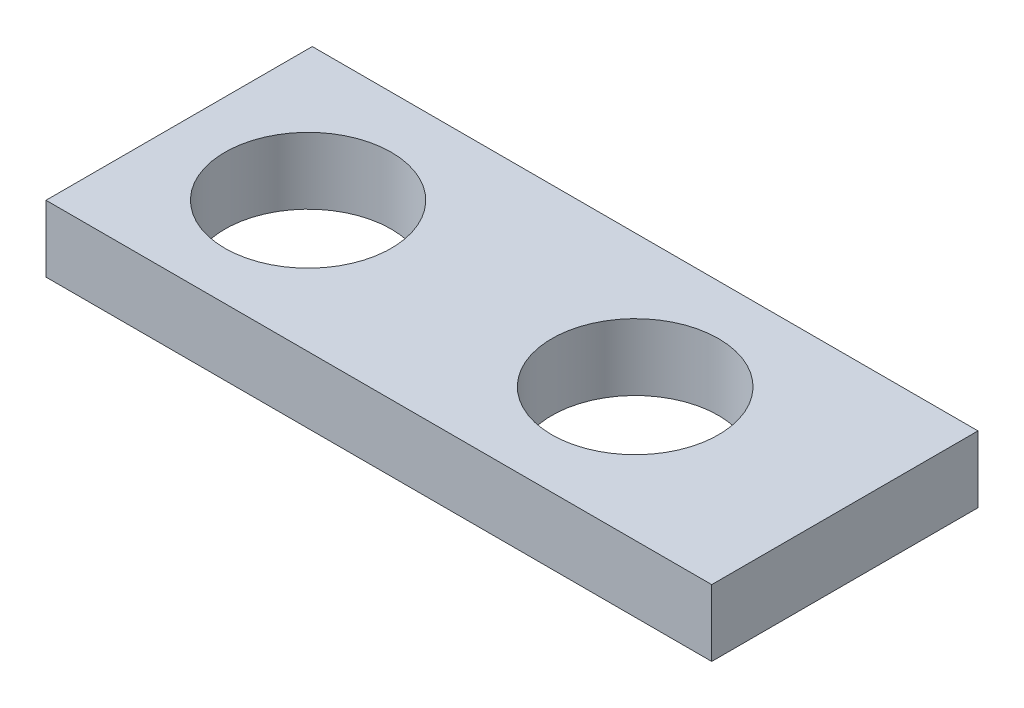
ISO-10303-21;
HEADER;
FILE_DESCRIPTION(('STEP AP214'),'2;1');
FILE_NAME('part.step','',(''),(''),'','','');
FILE_SCHEMA(('AUTOMOTIVE_DESIGN { 1 0 10303 214 1 1 1 1 }'));
ENDSEC;
DATA;
#1=APPLICATION_CONTEXT('core data for automotive mechanical design processes');
#2=APPLICATION_PROTOCOL_DEFINITION('international standard','automotive_design',2000,#1);
#3=PRODUCT_CONTEXT('',#1,'mechanical');
#4=PRODUCT('Part','Part','',(#3));
#5=PRODUCT_RELATED_PRODUCT_CATEGORY('part','',(#4));
#6=PRODUCT_DEFINITION_FORMATION('','',#4);
#7=PRODUCT_DEFINITION_CONTEXT('part definition',#1,'design');
#8=PRODUCT_DEFINITION('design','',#6,#7);
#9=PRODUCT_DEFINITION_SHAPE('','',#8);
#10=(LENGTH_UNIT() NAMED_UNIT(*) SI_UNIT(.MILLI.,.METRE.));
#11=(NAMED_UNIT(*) PLANE_ANGLE_UNIT() SI_UNIT($,.RADIAN.));
#12=(NAMED_UNIT(*) SI_UNIT($,.STERADIAN.) SOLID_ANGLE_UNIT());
#13=UNCERTAINTY_MEASURE_WITH_UNIT(LENGTH_MEASURE(1.E-05),#10,'distance_accuracy_value','');
#14=(GEOMETRIC_REPRESENTATION_CONTEXT(3) GLOBAL_UNCERTAINTY_ASSIGNED_CONTEXT((#13)) GLOBAL_UNIT_ASSIGNED_CONTEXT((#10,
#11,#12)) REPRESENTATION_CONTEXT('',''));
#15=CARTESIAN_POINT('',(0.,0.,0.));
#16=DIRECTION('',(0.,0.,1.));
#17=DIRECTION('',(1.,0.,0.));
#18=AXIS2_PLACEMENT_3D('',#15,#16,#17);
#19=CARTESIAN_POINT('',(0.,12.7,0.));
#20=DIRECTION('',(1.,0.,0.));
#21=DIRECTION('',(0.,0.,-1.));
#22=AXIS2_PLACEMENT_3D('',#19,#20,#21);
#23=PLANE('',#22);
#24=DIRECTION('',(0.,0.,1.));
#25=VECTOR('',#24,1.);
#26=CARTESIAN_POINT('',(0.,0.,0.));
#27=LINE('',#26,#25);
#28=CARTESIAN_POINT('',(0.,0.,-50.8));
#29=VERTEX_POINT('',#28);
#30=CARTESIAN_POINT('',(0.,0.,0.));
#31=VERTEX_POINT('',#30);
#32=EDGE_CURVE('E94',#29,#31,#27,.T.);
#33=ORIENTED_EDGE('',*,*,#32,.T.);
#34=DIRECTION('',(0.,-1.,0.));
#35=VECTOR('',#34,1.);
#36=CARTESIAN_POINT('',(0.,12.7,0.));
#37=LINE('',#36,#35);
#38=CARTESIAN_POINT('',(0.,12.7,0.));
#39=VERTEX_POINT('',#38);
#40=EDGE_CURVE('E11',#39,#31,#37,.T.);
#41=ORIENTED_EDGE('',*,*,#40,.F.);
#42=DIRECTION('',(0.,0.,1.));
#43=VECTOR('',#42,1.);
#44=CARTESIAN_POINT('',(0.,12.7,0.));
#45=LINE('',#44,#43);
#46=CARTESIAN_POINT('',(0.,12.7,-50.8));
#47=VERTEX_POINT('',#46);
#48=EDGE_CURVE('E82',#47,#39,#45,.T.);
#49=ORIENTED_EDGE('',*,*,#48,.F.);
#50=DIRECTION('',(0.,-1.,0.));
#51=VECTOR('',#50,1.);
#52=CARTESIAN_POINT('',(0.,12.7,-50.8));
#53=LINE('',#52,#51);
#54=EDGE_CURVE('E90',#47,#29,#53,.T.);
#55=ORIENTED_EDGE('',*,*,#54,.T.);
#56=EDGE_LOOP('',(#33,#41,#49,#55));
#57=FACE_BOUND('',#56,.T.);
#58=ADVANCED_FACE('F31',(#57),#23,.F.);
#59=CARTESIAN_POINT('',(0.,12.7,0.));
#60=DIRECTION('',(0.,0.,-1.));
#61=DIRECTION('',(-1.,0.,0.));
#62=AXIS2_PLACEMENT_3D('',#59,#60,#61);
#63=PLANE('',#62);
#64=DIRECTION('',(1.,0.,0.));
#65=VECTOR('',#64,1.);
#66=CARTESIAN_POINT('',(0.,0.,0.));
#67=LINE('',#66,#65);
#68=CARTESIAN_POINT('',(127.,0.,0.));
#69=VERTEX_POINT('',#68);
#70=EDGE_CURVE('E86',#31,#69,#67,.T.);
#71=ORIENTED_EDGE('',*,*,#70,.T.);
#72=DIRECTION('',(0.,-1.,0.));
#73=VECTOR('',#72,1.);
#74=CARTESIAN_POINT('',(127.,12.7,0.));
#75=LINE('',#74,#73);
#76=CARTESIAN_POINT('',(127.,12.7,0.));
#77=VERTEX_POINT('',#76);
#78=EDGE_CURVE('E39',#77,#69,#75,.T.);
#79=ORIENTED_EDGE('',*,*,#78,.F.);
#80=DIRECTION('',(1.,0.,0.));
#81=VECTOR('',#80,1.);
#82=CARTESIAN_POINT('',(0.,12.7,0.));
#83=LINE('',#82,#81);
#84=EDGE_CURVE('E77',#39,#77,#83,.T.);
#85=ORIENTED_EDGE('',*,*,#84,.F.);
#86=ORIENTED_EDGE('',*,*,#40,.T.);
#87=EDGE_LOOP('',(#71,#79,#85,#86));
#88=FACE_BOUND('',#87,.T.);
#89=ADVANCED_FACE('F85',(#88),#63,.F.);
#90=CARTESIAN_POINT('',(127.,12.7,0.));
#91=DIRECTION('',(-1.,0.,0.));
#92=DIRECTION('',(0.,0.,1.));
#93=AXIS2_PLACEMENT_3D('',#90,#91,#92);
#94=PLANE('',#93);
#95=DIRECTION('',(0.,0.,-1.));
#96=VECTOR('',#95,1.);
#97=CARTESIAN_POINT('',(127.,0.,0.));
#98=LINE('',#97,#96);
#99=CARTESIAN_POINT('',(127.,0.,-50.8));
#100=VERTEX_POINT('',#99);
#101=EDGE_CURVE('E64',#69,#100,#98,.T.);
#102=ORIENTED_EDGE('',*,*,#101,.T.);
#103=DIRECTION('',(0.,-1.,0.));
#104=VECTOR('',#103,1.);
#105=CARTESIAN_POINT('',(127.,12.7,-50.8));
#106=LINE('',#105,#104);
#107=CARTESIAN_POINT('',(127.,12.7,-50.8));
#108=VERTEX_POINT('',#107);
#109=EDGE_CURVE('E87',#108,#100,#106,.T.);
#110=ORIENTED_EDGE('',*,*,#109,.F.);
#111=DIRECTION('',(0.,0.,-1.));
#112=VECTOR('',#111,1.);
#113=CARTESIAN_POINT('',(127.,12.7,0.));
#114=LINE('',#113,#112);
#115=EDGE_CURVE('E80',#77,#108,#114,.T.);
#116=ORIENTED_EDGE('',*,*,#115,.F.);
#117=ORIENTED_EDGE('',*,*,#78,.T.);
#118=EDGE_LOOP('',(#102,#110,#116,#117));
#119=FACE_BOUND('',#118,.T.);
#120=ADVANCED_FACE('F88',(#119),#94,.F.);
#121=CARTESIAN_POINT('',(0.,12.7,-50.8));
#122=DIRECTION('',(0.,0.,1.));
#123=DIRECTION('',(1.,0.,0.));
#124=AXIS2_PLACEMENT_3D('',#121,#122,#123);
#125=PLANE('',#124);
#126=DIRECTION('',(-1.,0.,0.));
#127=VECTOR('',#126,1.);
#128=CARTESIAN_POINT('',(0.,0.,-50.8));
#129=LINE('',#128,#127);
#130=EDGE_CURVE('E70',#100,#29,#129,.T.);
#131=ORIENTED_EDGE('',*,*,#130,.T.);
#132=ORIENTED_EDGE('',*,*,#54,.F.);
#133=DIRECTION('',(-1.,0.,0.));
#134=VECTOR('',#133,1.);
#135=CARTESIAN_POINT('',(0.,12.7,-50.8));
#136=LINE('',#135,#134);
#137=EDGE_CURVE('E47',#108,#47,#136,.T.);
#138=ORIENTED_EDGE('',*,*,#137,.F.);
#139=ORIENTED_EDGE('',*,*,#109,.T.);
#140=EDGE_LOOP('',(#131,#132,#138,#139));
#141=FACE_BOUND('',#140,.T.);
#142=ADVANCED_FACE('F102',(#141),#125,.F.);
#143=CARTESIAN_POINT('',(0.,12.7,-50.8));
#144=DIRECTION('',(0.,-1.,0.));
#145=DIRECTION('',(0.,0.,-1.));
#146=AXIS2_PLACEMENT_3D('',#143,#144,#145);
#147=PLANE('',#146);
#148=CARTESIAN_POINT('',(87.,12.7,-25.4));
#149=DIRECTION('',(0.,1.,0.));
#150=DIRECTION('',(0.,0.,1.));
#151=AXIS2_PLACEMENT_3D('',#148,#149,#150);
#152=CIRCLE('',#151,15.9);
#153=CARTESIAN_POINT('',(87.,12.7,-9.5));
#154=VERTEX_POINT('',#153);
#155=EDGE_CURVE('E114',#154,#154,#152,.T.);
#156=ORIENTED_EDGE('',*,*,#155,.F.);
#157=EDGE_LOOP('',(#156));
#158=FACE_BOUND('',#157,.T.);
#159=CARTESIAN_POINT('',(25.,12.7,-25.));
#160=DIRECTION('',(0.,1.,0.));
#161=DIRECTION('',(0.,0.,1.));
#162=AXIS2_PLACEMENT_3D('',#159,#160,#161);
#163=CIRCLE('',#162,15.875);
#164=CARTESIAN_POINT('',(25.,12.7,-9.12500000000001));
#165=VERTEX_POINT('',#164);
#166=EDGE_CURVE('E108',#165,#165,#163,.T.);
#167=ORIENTED_EDGE('',*,*,#166,.F.);
#168=EDGE_LOOP('',(#167));
#169=FACE_BOUND('',#168,.T.);
#170=ORIENTED_EDGE('',*,*,#48,.T.);
#171=ORIENTED_EDGE('',*,*,#84,.T.);
#172=ORIENTED_EDGE('',*,*,#115,.T.);
#173=ORIENTED_EDGE('',*,*,#137,.T.);
#174=EDGE_LOOP('',(#170,#171,#172,#173));
#175=FACE_BOUND('',#174,.T.);
#176=ADVANCED_FACE('F78',(#158,#169,#175),#147,.F.);
#177=CARTESIAN_POINT('',(0.,0.,-50.8));
#178=DIRECTION('',(0.,-1.,0.));
#179=DIRECTION('',(0.,0.,-1.));
#180=AXIS2_PLACEMENT_3D('',#177,#178,#179);
#181=PLANE('',#180);
#182=CARTESIAN_POINT('',(87.,0.,-25.4));
#183=DIRECTION('',(0.,1.,0.));
#184=DIRECTION('',(0.,0.,1.));
#185=AXIS2_PLACEMENT_3D('',#182,#183,#184);
#186=CIRCLE('',#185,15.9);
#187=CARTESIAN_POINT('',(87.,0.,-9.5));
#188=VERTEX_POINT('',#187);
#189=EDGE_CURVE('E111',#188,#188,#186,.T.);
#190=ORIENTED_EDGE('',*,*,#189,.T.);
#191=EDGE_LOOP('',(#190));
#192=FACE_BOUND('',#191,.T.);
#193=CARTESIAN_POINT('',(25.,0.,-25.));
#194=DIRECTION('',(0.,1.,0.));
#195=DIRECTION('',(0.,0.,1.));
#196=AXIS2_PLACEMENT_3D('',#193,#194,#195);
#197=CIRCLE('',#196,15.875);
#198=CARTESIAN_POINT('',(25.,0.,-9.12500000000001));
#199=VERTEX_POINT('',#198);
#200=EDGE_CURVE('E97',#199,#199,#197,.T.);
#201=ORIENTED_EDGE('',*,*,#200,.T.);
#202=EDGE_LOOP('',(#201));
#203=FACE_BOUND('',#202,.T.);
#204=ORIENTED_EDGE('',*,*,#32,.F.);
#205=ORIENTED_EDGE('',*,*,#130,.F.);
#206=ORIENTED_EDGE('',*,*,#101,.F.);
#207=ORIENTED_EDGE('',*,*,#70,.F.);
#208=EDGE_LOOP('',(#204,#205,#206,#207));
#209=FACE_BOUND('',#208,.T.);
#210=ADVANCED_FACE('F105',(#192,#203,#209),#181,.T.);
#211=CARTESIAN_POINT('',(25.,0.,-25.));
#212=DIRECTION('',(0.,1.,0.));
#213=DIRECTION('',(0.,0.,1.));
#214=AXIS2_PLACEMENT_3D('',#211,#212,#213);
#215=CYLINDRICAL_SURFACE('',#214,15.875);
#216=ORIENTED_EDGE('',*,*,#200,.F.);
#217=EDGE_LOOP('',(#216));
#218=FACE_BOUND('',#217,.T.);
#219=ORIENTED_EDGE('',*,*,#166,.T.);
#220=EDGE_LOOP('',(#219));
#221=FACE_BOUND('',#220,.T.);
#222=ADVANCED_FACE('F125',(#218,#221),#215,.F.);
#223=CARTESIAN_POINT('',(87.,0.,-25.4));
#224=DIRECTION('',(0.,1.,0.));
#225=DIRECTION('',(0.,0.,1.));
#226=AXIS2_PLACEMENT_3D('',#223,#224,#225);
#227=CYLINDRICAL_SURFACE('',#226,15.9);
#228=ORIENTED_EDGE('',*,*,#189,.F.);
#229=EDGE_LOOP('',(#228));
#230=FACE_BOUND('',#229,.T.);
#231=ORIENTED_EDGE('',*,*,#155,.T.);
#232=EDGE_LOOP('',(#231));
#233=FACE_BOUND('',#232,.T.);
#234=ADVANCED_FACE('F122',(#230,#233),#227,.F.);
#235=CLOSED_SHELL('',(#58,#89,#120,#142,#176,#210,#222,#234));
#236=MANIFOLD_SOLID_BREP('B2',#235);
#237=ADVANCED_BREP_SHAPE_REPRESENTATION('',(#18,#236),#14);
#238=SHAPE_DEFINITION_REPRESENTATION(#9,#237);
ENDSEC;
END-ISO-10303-21;
